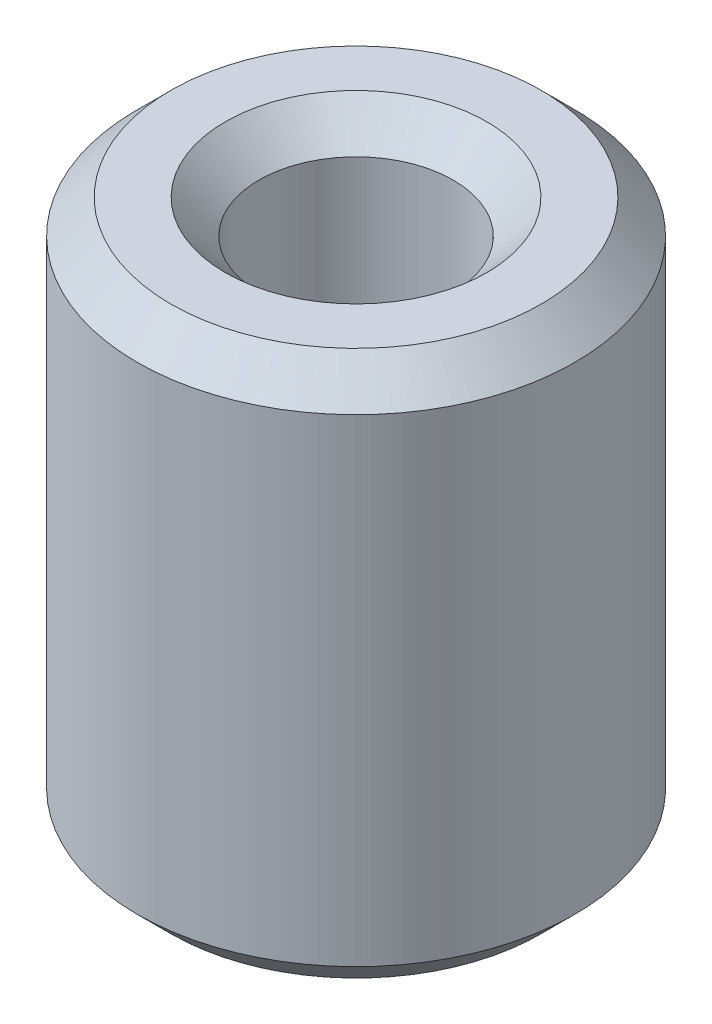
ISO-10303-21;
HEADER;
FILE_DESCRIPTION(('STEP AP214'),'2;1');
FILE_NAME('part.step','',(''),(''),'','','');
FILE_SCHEMA(('AUTOMOTIVE_DESIGN { 1 0 10303 214 1 1 1 1 }'));
ENDSEC;
DATA;
#1=APPLICATION_CONTEXT('core data for automotive mechanical design processes');
#2=APPLICATION_PROTOCOL_DEFINITION('international standard','automotive_design',2000,#1);
#3=PRODUCT_CONTEXT('',#1,'mechanical');
#4=PRODUCT('Part','Part','',(#3));
#5=PRODUCT_RELATED_PRODUCT_CATEGORY('part','',(#4));
#6=PRODUCT_DEFINITION_FORMATION('','',#4);
#7=PRODUCT_DEFINITION_CONTEXT('part definition',#1,'design');
#8=PRODUCT_DEFINITION('design','',#6,#7);
#9=PRODUCT_DEFINITION_SHAPE('','',#8);
#10=(LENGTH_UNIT() NAMED_UNIT(*) SI_UNIT(.MILLI.,.METRE.));
#11=(NAMED_UNIT(*) PLANE_ANGLE_UNIT() SI_UNIT($,.RADIAN.));
#12=(NAMED_UNIT(*) SI_UNIT($,.STERADIAN.) SOLID_ANGLE_UNIT());
#13=UNCERTAINTY_MEASURE_WITH_UNIT(LENGTH_MEASURE(1.E-05),#10,'distance_accuracy_value','');
#14=(GEOMETRIC_REPRESENTATION_CONTEXT(3) GLOBAL_UNCERTAINTY_ASSIGNED_CONTEXT((#13)) GLOBAL_UNIT_ASSIGNED_CONTEXT((#10,
#11,#12)) REPRESENTATION_CONTEXT('',''));
#15=CARTESIAN_POINT('',(0.,0.,0.));
#16=DIRECTION('',(0.,0.,1.));
#17=DIRECTION('',(1.,0.,0.));
#18=AXIS2_PLACEMENT_3D('',#15,#16,#17);
#19=CARTESIAN_POINT('',(0.,43.6093092546974,0.));
#20=DIRECTION('',(0.,-1.,0.));
#21=DIRECTION('',(0.,0.,-1.));
#22=AXIS2_PLACEMENT_3D('',#19,#20,#21);
#23=CYLINDRICAL_SURFACE('',#22,17.5);
#24=CARTESIAN_POINT('',(0.,2.69144056030178,0.));
#25=DIRECTION('',(0.,1.,0.));
#26=DIRECTION('',(0.,0.,1.));
#27=AXIS2_PLACEMENT_3D('',#24,#25,#26);
#28=CIRCLE('',#27,17.5);
#29=CARTESIAN_POINT('',(0.,2.69144056030178,17.5));
#30=VERTEX_POINT('',#29);
#31=EDGE_CURVE('E10',#30,#30,#28,.T.);
#32=ORIENTED_EDGE('',*,*,#31,.T.);
#33=EDGE_LOOP('',(#32));
#34=FACE_BOUND('',#33,.T.);
#35=CARTESIAN_POINT('',(0.,40.9178686943956,0.));
#36=DIRECTION('',(0.,1.,0.));
#37=DIRECTION('',(0.,0.,1.));
#38=AXIS2_PLACEMENT_3D('',#35,#36,#37);
#39=CIRCLE('',#38,17.5);
#40=CARTESIAN_POINT('',(0.,40.9178686943956,17.5));
#41=VERTEX_POINT('',#40);
#42=EDGE_CURVE('E50',#41,#41,#39,.F.);
#43=ORIENTED_EDGE('',*,*,#42,.T.);
#44=EDGE_LOOP('',(#43));
#45=FACE_BOUND('',#44,.T.);
#46=ADVANCED_FACE('F39',(#34,#45),#23,.T.);
#47=CARTESIAN_POINT('',(0.,43.6093092546974,0.));
#48=DIRECTION('',(0.,1.,0.));
#49=DIRECTION('',(0.,0.,1.));
#50=AXIS2_PLACEMENT_3D('',#47,#48,#49);
#51=PLANE('',#50);
#52=CARTESIAN_POINT('',(0.,43.6093092546974,0.));
#53=DIRECTION('',(0.,1.,0.));
#54=DIRECTION('',(0.,0.,1.));
#55=AXIS2_PLACEMENT_3D('',#52,#53,#54);
#56=CIRCLE('',#55,10.4563484219007);
#57=CARTESIAN_POINT('',(0.,43.6093092546974,10.4563484219007));
#58=VERTEX_POINT('',#57);
#59=EDGE_CURVE('E58',#58,#58,#56,.F.);
#60=ORIENTED_EDGE('',*,*,#59,.T.);
#61=EDGE_LOOP('',(#60));
#62=FACE_BOUND('',#61,.T.);
#63=CARTESIAN_POINT('',(0.,43.6093092546974,0.));
#64=DIRECTION('',(0.,1.,0.));
#65=DIRECTION('',(0.,0.,1.));
#66=AXIS2_PLACEMENT_3D('',#63,#64,#65);
#67=CIRCLE('',#66,14.8085594396982);
#68=CARTESIAN_POINT('',(0.,43.6093092546974,14.8085594396982));
#69=VERTEX_POINT('',#68);
#70=EDGE_CURVE('E61',#69,#69,#67,.T.);
#71=ORIENTED_EDGE('',*,*,#70,.T.);
#72=EDGE_LOOP('',(#71));
#73=FACE_BOUND('',#72,.T.);
#74=ADVANCED_FACE('F88',(#62,#73),#51,.T.);
#75=CARTESIAN_POINT('',(0.,0.,0.));
#76=DIRECTION('',(0.,1.,0.));
#77=DIRECTION('',(0.,0.,1.));
#78=AXIS2_PLACEMENT_3D('',#75,#76,#77);
#79=PLANE('',#78);
#80=CARTESIAN_POINT('',(0.,0.,0.));
#81=DIRECTION('',(0.,1.,0.));
#82=DIRECTION('',(0.,0.,1.));
#83=AXIS2_PLACEMENT_3D('',#80,#81,#82);
#84=CIRCLE('',#83,10.4563484219007);
#85=CARTESIAN_POINT('',(0.,0.,-10.4563484219007));
#86=VERTEX_POINT('',#85);
#87=EDGE_CURVE('E51',#86,#86,#84,.T.);
#88=ORIENTED_EDGE('',*,*,#87,.T.);
#89=EDGE_LOOP('',(#88));
#90=FACE_BOUND('',#89,.T.);
#91=CARTESIAN_POINT('',(0.,0.,0.));
#92=DIRECTION('',(0.,1.,0.));
#93=DIRECTION('',(0.,0.,1.));
#94=AXIS2_PLACEMENT_3D('',#91,#92,#93);
#95=CIRCLE('',#94,14.8085594396982);
#96=CARTESIAN_POINT('',(0.,0.,14.8085594396982));
#97=VERTEX_POINT('',#96);
#98=EDGE_CURVE('E54',#97,#97,#95,.F.);
#99=ORIENTED_EDGE('',*,*,#98,.T.);
#100=EDGE_LOOP('',(#99));
#101=FACE_BOUND('',#100,.T.);
#102=ADVANCED_FACE('F83',(#90,#101),#79,.F.);
#103=CARTESIAN_POINT('',(0.,43.6093092546974,0.));
#104=DIRECTION('',(0.,-1.,0.));
#105=DIRECTION('',(0.,0.,-1.));
#106=AXIS2_PLACEMENT_3D('',#103,#104,#105);
#107=CYLINDRICAL_SURFACE('',#106,7.76490786159887);
#108=CARTESIAN_POINT('',(0.,40.9178686943956,0.));
#109=DIRECTION('',(0.,1.,0.));
#110=DIRECTION('',(0.,0.,1.));
#111=AXIS2_PLACEMENT_3D('',#108,#109,#110);
#112=CIRCLE('',#111,7.76490786159887);
#113=CARTESIAN_POINT('',(0.,40.9178686943956,7.76490786159887));
#114=VERTEX_POINT('',#113);
#115=EDGE_CURVE('E67',#114,#114,#112,.T.);
#116=ORIENTED_EDGE('',*,*,#115,.T.);
#117=EDGE_LOOP('',(#116));
#118=FACE_BOUND('',#117,.T.);
#119=CARTESIAN_POINT('',(0.,2.69144056030182,0.));
#120=DIRECTION('',(0.,1.,0.));
#121=DIRECTION('',(0.,0.,1.));
#122=AXIS2_PLACEMENT_3D('',#119,#120,#121);
#123=CIRCLE('',#122,7.76490786159887);
#124=CARTESIAN_POINT('',(0.,2.69144056030182,-7.76490786159887));
#125=VERTEX_POINT('',#124);
#126=EDGE_CURVE('E69',#125,#125,#123,.F.);
#127=ORIENTED_EDGE('',*,*,#126,.T.);
#128=EDGE_LOOP('',(#127));
#129=FACE_BOUND('',#128,.T.);
#130=ADVANCED_FACE('F71',(#118,#129),#107,.F.);
#131=CARTESIAN_POINT('',(0.,40.9178686943956,0.));
#132=DIRECTION('',(0.,1.,0.));
#133=DIRECTION('',(0.,0.,1.));
#134=AXIS2_PLACEMENT_3D('',#131,#132,#133);
#135=CONICAL_SURFACE('',#134,7.76490786159887,0.785398163397451);
#136=ORIENTED_EDGE('',*,*,#59,.F.);
#137=EDGE_LOOP('',(#136));
#138=FACE_BOUND('',#137,.T.);
#139=ORIENTED_EDGE('',*,*,#115,.F.);
#140=EDGE_LOOP('',(#139));
#141=FACE_BOUND('',#140,.T.);
#142=ADVANCED_FACE('F77',(#138,#141),#135,.F.);
#143=CARTESIAN_POINT('',(0.,0.,0.));
#144=DIRECTION('',(0.,-1.,0.));
#145=DIRECTION('',(0.,0.,-1.));
#146=AXIS2_PLACEMENT_3D('',#143,#144,#145);
#147=CONICAL_SURFACE('',#146,10.4563484219007,0.785398163397445);
#148=CARTESIAN_POINT('',(0.,2.69144056030182,-7.76490786159887));
#149=CARTESIAN_POINT('',(0.,2.66340472113201,-7.79294370076868));
#150=CARTESIAN_POINT('',(0.,2.6353688819622,-7.82097953993849));
#151=CARTESIAN_POINT('',(0.,2.57929720362258,-7.87705121827811));
#152=CARTESIAN_POINT('',(0.,2.55126136445277,-7.90508705744792));
#153=CARTESIAN_POINT('',(0.,2.49518968611315,-7.96115873578754));
#154=CARTESIAN_POINT('',(0.,2.46715384694334,-7.98919457495735));
#155=CARTESIAN_POINT('',(0.,2.41108216860372,-8.04526625329697));
#156=CARTESIAN_POINT('',(0.,2.3830463294339,-8.07330209246678));
#157=CARTESIAN_POINT('',(0.,2.32697465109428,-8.1293737708064));
#158=CARTESIAN_POINT('',(0.,2.29893881192447,-8.15740960997621));
#159=CARTESIAN_POINT('',(0.,2.24286713358485,-8.21348128831584));
#160=CARTESIAN_POINT('',(0.,2.21483129441504,-8.24151712748565));
#161=CARTESIAN_POINT('',(0.,2.15875961607542,-8.29758880582527));
#162=CARTESIAN_POINT('',(0.,2.13072377690561,-8.32562464499508));
#163=CARTESIAN_POINT('',(0.,2.07465209856599,-8.3816963233347));
#164=CARTESIAN_POINT('',(0.,2.04661625939618,-8.40973216250451));
#165=CARTESIAN_POINT('',(0.,1.99054458105656,-8.46580384084413));
#166=CARTESIAN_POINT('',(0.,1.96250874188674,-8.49383968001394));
#167=CARTESIAN_POINT('',(0.,1.90643706354712,-8.54991135835356));
#168=CARTESIAN_POINT('',(0.,1.87840122437731,-8.57794719752337));
#169=CARTESIAN_POINT('',(0.,1.82232954603769,-8.63401887586299));
#170=CARTESIAN_POINT('',(0.,1.79429370686788,-8.6620547150328));
#171=CARTESIAN_POINT('',(0.,1.73822202852826,-8.71812639337242));
#172=CARTESIAN_POINT('',(0.,1.71018618935845,-8.74616223254223));
#173=CARTESIAN_POINT('',(0.,1.65411451101883,-8.80223391088186));
#174=CARTESIAN_POINT('',(0.,1.62607867184902,-8.83026975005166));
#175=CARTESIAN_POINT('',(0.,1.5700069935094,-8.88634142839129));
#176=CARTESIAN_POINT('',(0.,1.54197115433959,-8.9143772675611));
#177=CARTESIAN_POINT('',(0.,1.48589947599996,-8.97044894590072));
#178=CARTESIAN_POINT('',(0.,1.45786363683015,-8.99848478507053));
#179=CARTESIAN_POINT('',(0.,1.40179195849053,-9.05455646341015));
#180=CARTESIAN_POINT('',(0.,1.37375611932072,-9.08259230257996));
#181=CARTESIAN_POINT('',(0.,1.3176844409811,-9.13866398091958));
#182=CARTESIAN_POINT('',(0.,1.28964860181129,-9.16669982008939));
#183=CARTESIAN_POINT('',(0.,1.23357692347167,-9.22277149842901));
#184=CARTESIAN_POINT('',(0.,1.20554108430186,-9.25080733759882));
#185=CARTESIAN_POINT('',(0.,1.14946940596224,-9.30687901593844));
#186=CARTESIAN_POINT('',(0.,1.12143356679243,-9.33491485510825));
#187=CARTESIAN_POINT('',(0.,1.0653618884528,-9.39098653344787));
#188=CARTESIAN_POINT('',(0.,1.03732604928299,-9.41902237261768));
#189=CARTESIAN_POINT('',(0.,0.981254370943373,-9.47509405095731));
#190=CARTESIAN_POINT('',(0.,0.953218531773562,-9.50312989012711));
#191=CARTESIAN_POINT('',(0.,0.897146853433941,-9.55920156846674));
#192=CARTESIAN_POINT('',(0.,0.86911101426413,-9.58723740763655));
#193=CARTESIAN_POINT('',(0.,0.813039335924509,-9.64330908597617));
#194=CARTESIAN_POINT('',(0.,0.785003496754698,-9.67134492514598));
#195=CARTESIAN_POINT('',(0.,0.728931818415077,-9.7274166034856));
#196=CARTESIAN_POINT('',(0.,0.700895979245266,-9.75545244265541));
#197=CARTESIAN_POINT('',(0.,0.644824300905645,-9.81152412099503));
#198=CARTESIAN_POINT('',(0.,0.616788461735834,-9.83955996016484));
#199=CARTESIAN_POINT('',(0.,0.560716783396213,-9.89563163850446));
#200=CARTESIAN_POINT('',(0.,0.532680944226402,-9.92366747767427));
#201=CARTESIAN_POINT('',(0.,0.476609265886781,-9.97973915601389));
#202=CARTESIAN_POINT('',(0.,0.44857342671697,-10.0077749951837));
#203=CARTESIAN_POINT('',(0.,0.392501748377349,-10.0638466735233));
#204=CARTESIAN_POINT('',(0.,0.364465909207538,-10.0918825126931));
#205=CARTESIAN_POINT('',(0.,0.308394230867917,-10.1479541910328));
#206=CARTESIAN_POINT('',(0.,0.280358391698107,-10.1759900302026));
#207=CARTESIAN_POINT('',(0.,0.224286713358485,-10.2320617085422));
#208=CARTESIAN_POINT('',(0.,0.196250874188675,-10.260097547712));
#209=CARTESIAN_POINT('',(0.,0.140179195849053,-10.3161692260516));
#210=CARTESIAN_POINT('',(0.,0.112143356679243,-10.3442050652214));
#211=CARTESIAN_POINT('',(0.,0.0560716783396213,-10.4002767435611));
#212=CARTESIAN_POINT('',(0.,0.0280358391698107,-10.4283125827309));
#213=CARTESIAN_POINT('',(0.,0.,-10.4563484219007));
#214=B_SPLINE_CURVE_WITH_KNOTS('',3,(#148,#149,#150,#151,#152,#153,#154,#155,#156,#157,#158,
#159,#160,#161,#162,#163,#164,#165,#166,#167,#168,#169,#170,#171,#172,#173,#174,#175,#176,#177,
#178,#179,#180,#181,#182,#183,#184,#185,#186,#187,#188,#189,#190,#191,#192,#193,#194,#195,#196,
#197,#198,#199,#200,#201,#202,#203,#204,#205,#206,#207,#208,#209,#210,#211,#212,#213),
.UNSPECIFIED.,.F.,.F.,(4,2,2,2,2,2,2,2,2,2,2,2,2,2,2,2,2,2,2,2,2,2,2,2,2,2,2,2,2,2,2,2,4),(0.,
0.118945991959371,0.237891983918741,0.356837975878113,0.475783967837484,0.594729959796854,
0.713675951756225,0.832621943715595,0.951567935674966,1.07051392763434,1.18945991959371,
1.30840591155308,1.42735190351245,1.54629789547182,1.66524388743119,1.78418987939056,
1.90313587134993,2.0220818633093,2.14102785526867,2.25997384722805,2.37891983918742,
2.49786583114679,2.61681182310616,2.73575781506553,2.8547038070249,2.97364979898427,
3.09259579094364,3.21154178290301,3.33048777486238,3.44943376682175,3.56837975878112,
3.6873257507405,3.80627174269987),.UNSPECIFIED.);
#215=EDGE_CURVE('BSEAM73',#125,#86,#214,.T.);
#216=ORIENTED_EDGE('',*,*,#126,.F.);
#217=ORIENTED_EDGE('',*,*,#87,.F.);
#218=ORIENTED_EDGE('',*,*,#215,.T.);
#219=ORIENTED_EDGE('',*,*,#215,.F.);
#220=EDGE_LOOP('',(#216,#218,#217,#219));
#221=FACE_BOUND('',#220,.T.);
#222=ADVANCED_FACE('F73',(#221),#147,.F.);
#223=CARTESIAN_POINT('',(0.,2.69144056030178,0.));
#224=DIRECTION('',(0.,1.,0.));
#225=DIRECTION('',(0.,0.,1.));
#226=AXIS2_PLACEMENT_3D('',#223,#224,#225);
#227=CONICAL_SURFACE('',#226,17.5,0.785398163397453);
#228=ORIENTED_EDGE('',*,*,#98,.F.);
#229=EDGE_LOOP('',(#228));
#230=FACE_BOUND('',#229,.T.);
#231=ORIENTED_EDGE('',*,*,#31,.F.);
#232=EDGE_LOOP('',(#231));
#233=FACE_BOUND('',#232,.T.);
#234=ADVANCED_FACE('F76',(#230,#233),#227,.T.);
#235=CARTESIAN_POINT('',(0.,43.6093092546974,0.));
#236=DIRECTION('',(0.,-1.,0.));
#237=DIRECTION('',(0.,0.,-1.));
#238=AXIS2_PLACEMENT_3D('',#235,#236,#237);
#239=CONICAL_SURFACE('',#238,14.8085594396982,0.785398163397443);
#240=ORIENTED_EDGE('',*,*,#42,.F.);
#241=EDGE_LOOP('',(#240));
#242=FACE_BOUND('',#241,.T.);
#243=ORIENTED_EDGE('',*,*,#70,.F.);
#244=EDGE_LOOP('',(#243));
#245=FACE_BOUND('',#244,.T.);
#246=ADVANCED_FACE('F45',(#242,#245),#239,.T.);
#247=CLOSED_SHELL('',(#46,#74,#102,#130,#142,#222,#234,#246));
#248=MANIFOLD_SOLID_BREP('B2',#247);
#249=ADVANCED_BREP_SHAPE_REPRESENTATION('',(#18,#248),#14);
#250=SHAPE_DEFINITION_REPRESENTATION(#9,#249);
ENDSEC;
END-ISO-10303-21;
